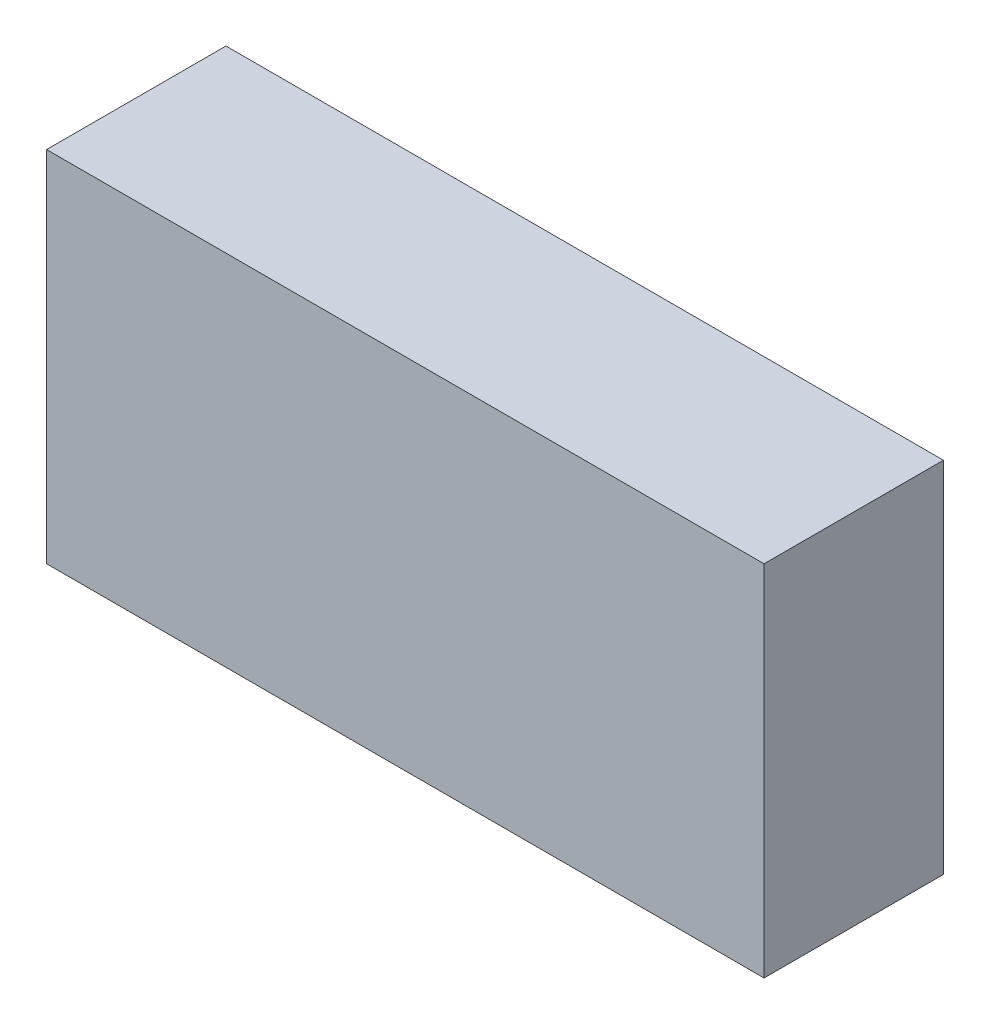
ISO-10303-21;
HEADER;
FILE_DESCRIPTION(('STEP AP214'),'2;1');
FILE_NAME('part.step','',(''),(''),'','','');
FILE_SCHEMA(('AUTOMOTIVE_DESIGN { 1 0 10303 214 1 1 1 1 }'));
ENDSEC;
DATA;
#1=APPLICATION_CONTEXT('core data for automotive mechanical design processes');
#2=APPLICATION_PROTOCOL_DEFINITION('international standard','automotive_design',2000,#1);
#3=PRODUCT_CONTEXT('',#1,'mechanical');
#4=PRODUCT('Part','Part','',(#3));
#5=PRODUCT_RELATED_PRODUCT_CATEGORY('part','',(#4));
#6=PRODUCT_DEFINITION_FORMATION('','',#4);
#7=PRODUCT_DEFINITION_CONTEXT('part definition',#1,'design');
#8=PRODUCT_DEFINITION('design','',#6,#7);
#9=PRODUCT_DEFINITION_SHAPE('','',#8);
#10=(LENGTH_UNIT() NAMED_UNIT(*) SI_UNIT(.MILLI.,.METRE.));
#11=(NAMED_UNIT(*) PLANE_ANGLE_UNIT() SI_UNIT($,.RADIAN.));
#12=(NAMED_UNIT(*) SI_UNIT($,.STERADIAN.) SOLID_ANGLE_UNIT());
#13=UNCERTAINTY_MEASURE_WITH_UNIT(LENGTH_MEASURE(1.E-05),#10,'distance_accuracy_value','');
#14=(GEOMETRIC_REPRESENTATION_CONTEXT(3) GLOBAL_UNCERTAINTY_ASSIGNED_CONTEXT((#13)) GLOBAL_UNIT_ASSIGNED_CONTEXT((#10,
#11,#12)) REPRESENTATION_CONTEXT('',''));
#15=CARTESIAN_POINT('',(0.,0.,0.));
#16=DIRECTION('',(0.,0.,1.));
#17=DIRECTION('',(1.,0.,0.));
#18=AXIS2_PLACEMENT_3D('',#15,#16,#17);
#19=CARTESIAN_POINT('',(0.,0.,5.));
#20=DIRECTION('',(1.,0.,0.));
#21=DIRECTION('',(0.,0.,-1.));
#22=AXIS2_PLACEMENT_3D('',#19,#20,#21);
#23=PLANE('',#22);
#24=DIRECTION('',(0.,-1.,0.));
#25=VECTOR('',#24,1.);
#26=CARTESIAN_POINT('',(0.,0.,0.));
#27=LINE('',#26,#25);
#28=CARTESIAN_POINT('',(0.,10.,0.));
#29=VERTEX_POINT('',#28);
#30=CARTESIAN_POINT('',(0.,0.,0.));
#31=VERTEX_POINT('',#30);
#32=EDGE_CURVE('E107',#29,#31,#27,.T.);
#33=ORIENTED_EDGE('',*,*,#32,.T.);
#34=DIRECTION('',(0.,0.,-1.));
#35=VECTOR('',#34,1.);
#36=CARTESIAN_POINT('',(0.,0.,5.));
#37=LINE('',#36,#35);
#38=CARTESIAN_POINT('',(0.,0.,5.));
#39=VERTEX_POINT('',#38);
#40=EDGE_CURVE('E11',#39,#31,#37,.T.);
#41=ORIENTED_EDGE('',*,*,#40,.F.);
#42=DIRECTION('',(0.,-1.,0.));
#43=VECTOR('',#42,1.);
#44=CARTESIAN_POINT('',(0.,0.,5.));
#45=LINE('',#44,#43);
#46=CARTESIAN_POINT('',(0.,10.,5.));
#47=VERTEX_POINT('',#46);
#48=EDGE_CURVE('E91',#47,#39,#45,.T.);
#49=ORIENTED_EDGE('',*,*,#48,.F.);
#50=DIRECTION('',(0.,0.,-1.));
#51=VECTOR('',#50,1.);
#52=CARTESIAN_POINT('',(0.,10.,5.));
#53=LINE('',#52,#51);
#54=EDGE_CURVE('E103',#47,#29,#53,.T.);
#55=ORIENTED_EDGE('',*,*,#54,.T.);
#56=EDGE_LOOP('',(#33,#41,#49,#55));
#57=FACE_BOUND('',#56,.T.);
#58=ADVANCED_FACE('F39',(#57),#23,.F.);
#59=CARTESIAN_POINT('',(0.,0.,5.));
#60=DIRECTION('',(0.,1.,0.));
#61=DIRECTION('',(0.,0.,1.));
#62=AXIS2_PLACEMENT_3D('',#59,#60,#61);
#63=PLANE('',#62);
#64=DIRECTION('',(1.,0.,0.));
#65=VECTOR('',#64,1.);
#66=CARTESIAN_POINT('',(0.,0.,0.));
#67=LINE('',#66,#65);
#68=CARTESIAN_POINT('',(20.,0.,0.));
#69=VERTEX_POINT('',#68);
#70=EDGE_CURVE('E96',#31,#69,#67,.T.);
#71=ORIENTED_EDGE('',*,*,#70,.T.);
#72=DIRECTION('',(0.,0.,-1.));
#73=VECTOR('',#72,1.);
#74=CARTESIAN_POINT('',(20.,0.,5.));
#75=LINE('',#74,#73);
#76=CARTESIAN_POINT('',(20.,0.,5.));
#77=VERTEX_POINT('',#76);
#78=EDGE_CURVE('E48',#77,#69,#75,.T.);
#79=ORIENTED_EDGE('',*,*,#78,.F.);
#80=DIRECTION('',(1.,0.,0.));
#81=VECTOR('',#80,1.);
#82=CARTESIAN_POINT('',(0.,0.,5.));
#83=LINE('',#82,#81);
#84=EDGE_CURVE('E86',#39,#77,#83,.T.);
#85=ORIENTED_EDGE('',*,*,#84,.F.);
#86=ORIENTED_EDGE('',*,*,#40,.T.);
#87=EDGE_LOOP('',(#71,#79,#85,#86));
#88=FACE_BOUND('',#87,.T.);
#89=ADVANCED_FACE('F95',(#88),#63,.F.);
#90=CARTESIAN_POINT('',(20.,0.,5.));
#91=DIRECTION('',(-1.,0.,0.));
#92=DIRECTION('',(0.,0.,1.));
#93=AXIS2_PLACEMENT_3D('',#90,#91,#92);
#94=PLANE('',#93);
#95=DIRECTION('',(0.,1.,0.));
#96=VECTOR('',#95,1.);
#97=CARTESIAN_POINT('',(20.,0.,0.));
#98=LINE('',#97,#96);
#99=CARTESIAN_POINT('',(20.,10.,0.));
#100=VERTEX_POINT('',#99);
#101=EDGE_CURVE('E73',#69,#100,#98,.T.);
#102=ORIENTED_EDGE('',*,*,#101,.T.);
#103=DIRECTION('',(0.,0.,-1.));
#104=VECTOR('',#103,1.);
#105=CARTESIAN_POINT('',(20.,10.,5.));
#106=LINE('',#105,#104);
#107=CARTESIAN_POINT('',(20.,10.,5.));
#108=VERTEX_POINT('',#107);
#109=EDGE_CURVE('E98',#108,#100,#106,.T.);
#110=ORIENTED_EDGE('',*,*,#109,.F.);
#111=DIRECTION('',(0.,1.,0.));
#112=VECTOR('',#111,1.);
#113=CARTESIAN_POINT('',(20.,0.,5.));
#114=LINE('',#113,#112);
#115=EDGE_CURVE('E89',#77,#108,#114,.T.);
#116=ORIENTED_EDGE('',*,*,#115,.F.);
#117=ORIENTED_EDGE('',*,*,#78,.T.);
#118=EDGE_LOOP('',(#102,#110,#116,#117));
#119=FACE_BOUND('',#118,.T.);
#120=ADVANCED_FACE('F99',(#119),#94,.F.);
#121=CARTESIAN_POINT('',(0.,10.,5.));
#122=DIRECTION('',(0.,-1.,0.));
#123=DIRECTION('',(0.,0.,-1.));
#124=AXIS2_PLACEMENT_3D('',#121,#122,#123);
#125=PLANE('',#124);
#126=DIRECTION('',(-1.,0.,0.));
#127=VECTOR('',#126,1.);
#128=CARTESIAN_POINT('',(0.,10.,0.));
#129=LINE('',#128,#127);
#130=EDGE_CURVE('E79',#100,#29,#129,.T.);
#131=ORIENTED_EDGE('',*,*,#130,.T.);
#132=ORIENTED_EDGE('',*,*,#54,.F.);
#133=DIRECTION('',(-1.,0.,0.));
#134=VECTOR('',#133,1.);
#135=CARTESIAN_POINT('',(0.,10.,5.));
#136=LINE('',#135,#134);
#137=EDGE_CURVE('E56',#108,#47,#136,.T.);
#138=ORIENTED_EDGE('',*,*,#137,.F.);
#139=ORIENTED_EDGE('',*,*,#109,.T.);
#140=EDGE_LOOP('',(#131,#132,#138,#139));
#141=FACE_BOUND('',#140,.T.);
#142=ADVANCED_FACE('F120',(#141),#125,.F.);
#143=CARTESIAN_POINT('',(0.,0.,5.));
#144=DIRECTION('',(0.,0.,-1.));
#145=DIRECTION('',(-1.,0.,0.));
#146=AXIS2_PLACEMENT_3D('',#143,#144,#145);
#147=PLANE('',#146);
#148=ORIENTED_EDGE('',*,*,#48,.T.);
#149=ORIENTED_EDGE('',*,*,#84,.T.);
#150=ORIENTED_EDGE('',*,*,#115,.T.);
#151=ORIENTED_EDGE('',*,*,#137,.T.);
#152=EDGE_LOOP('',(#148,#149,#150,#151));
#153=FACE_BOUND('',#152,.T.);
#154=ADVANCED_FACE('F87',(#153),#147,.F.);
#155=CARTESIAN_POINT('',(0.,0.,0.));
#156=DIRECTION('',(0.,0.,-1.));
#157=DIRECTION('',(-1.,0.,0.));
#158=AXIS2_PLACEMENT_3D('',#155,#156,#157);
#159=PLANE('',#158);
#160=ORIENTED_EDGE('',*,*,#32,.F.);
#161=ORIENTED_EDGE('',*,*,#130,.F.);
#162=ORIENTED_EDGE('',*,*,#101,.F.);
#163=ORIENTED_EDGE('',*,*,#70,.F.);
#164=EDGE_LOOP('',(#160,#161,#162,#163));
#165=FACE_BOUND('',#164,.T.);
#166=ADVANCED_FACE('F123',(#165),#159,.T.);
#167=CLOSED_SHELL('',(#58,#89,#120,#142,#154,#166));
#168=MANIFOLD_SOLID_BREP('B2',#167);
#169=ADVANCED_BREP_SHAPE_REPRESENTATION('',(#18,#168),#14);
#170=SHAPE_DEFINITION_REPRESENTATION(#9,#169);
ENDSEC;
END-ISO-10303-21;
